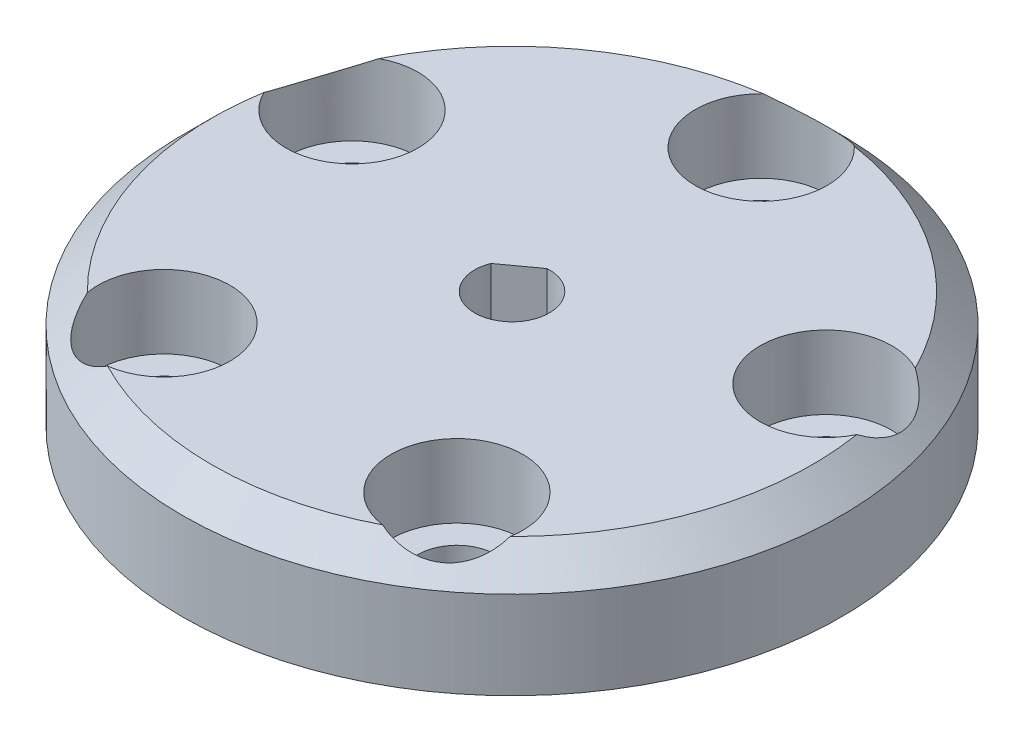
ISO-10303-21;
HEADER;
FILE_DESCRIPTION(('STEP AP214'),'2;1');
FILE_NAME('part.step','',(''),(''),'','','');
FILE_SCHEMA(('AUTOMOTIVE_DESIGN { 1 0 10303 214 1 1 1 1 }'));
ENDSEC;
DATA;
#1=APPLICATION_CONTEXT('core data for automotive mechanical design processes');
#2=APPLICATION_PROTOCOL_DEFINITION('international standard','automotive_design',2000,#1);
#3=PRODUCT_CONTEXT('',#1,'mechanical');
#4=PRODUCT('Part','Part','',(#3));
#5=PRODUCT_RELATED_PRODUCT_CATEGORY('part','',(#4));
#6=PRODUCT_DEFINITION_FORMATION('','',#4);
#7=PRODUCT_DEFINITION_CONTEXT('part definition',#1,'design');
#8=PRODUCT_DEFINITION('design','',#6,#7);
#9=PRODUCT_DEFINITION_SHAPE('','',#8);
#10=(LENGTH_UNIT() NAMED_UNIT(*) SI_UNIT(.MILLI.,.METRE.));
#11=(NAMED_UNIT(*) PLANE_ANGLE_UNIT() SI_UNIT($,.RADIAN.));
#12=(NAMED_UNIT(*) SI_UNIT($,.STERADIAN.) SOLID_ANGLE_UNIT());
#13=UNCERTAINTY_MEASURE_WITH_UNIT(LENGTH_MEASURE(1.E-05),#10,'distance_accuracy_value','');
#14=(GEOMETRIC_REPRESENTATION_CONTEXT(3) GLOBAL_UNCERTAINTY_ASSIGNED_CONTEXT((#13)) GLOBAL_UNIT_ASSIGNED_CONTEXT((#10,
#11,#12)) REPRESENTATION_CONTEXT('',''));
#15=CARTESIAN_POINT('',(0.,0.,0.));
#16=DIRECTION('',(0.,0.,1.));
#17=DIRECTION('',(1.,0.,0.));
#18=AXIS2_PLACEMENT_3D('',#15,#16,#17);
#19=CARTESIAN_POINT('',(0.,8.,-17.0130161670408));
#20=DIRECTION('',(0.,-1.,0.));
#21=DIRECTION('',(0.,0.,-1.));
#22=AXIS2_PLACEMENT_3D('',#19,#20,#21);
#23=CYLINDRICAL_SURFACE('',#22,2.65);
#24=CARTESIAN_POINT('',(0.,0.,-17.0130161670408));
#25=DIRECTION('',(0.,1.,0.));
#26=DIRECTION('',(0.,0.,1.));
#27=AXIS2_PLACEMENT_3D('',#24,#25,#26);
#28=CIRCLE('',#27,2.65);
#29=CARTESIAN_POINT('',(0.,0.,-14.3630161670408));
#30=VERTEX_POINT('',#29);
#31=EDGE_CURVE('E157',#30,#30,#28,.T.);
#32=ORIENTED_EDGE('',*,*,#31,.F.);
#33=EDGE_LOOP('',(#32));
#34=FACE_BOUND('',#33,.T.);
#35=CARTESIAN_POINT('',(0.,3.,-17.0130161670408));
#36=DIRECTION('',(0.,1.,0.));
#37=DIRECTION('',(0.,0.,1.));
#38=AXIS2_PLACEMENT_3D('',#35,#36,#37);
#39=CIRCLE('',#38,2.65);
#40=CARTESIAN_POINT('',(0.,3.,-14.3630161670408));
#41=VERTEX_POINT('',#40);
#42=EDGE_CURVE('E148',#41,#41,#39,.T.);
#43=ORIENTED_EDGE('',*,*,#42,.T.);
#44=EDGE_LOOP('',(#43));
#45=FACE_BOUND('',#44,.T.);
#46=ADVANCED_FACE('F35',(#34,#45),#23,.F.);
#47=CARTESIAN_POINT('',(-16.180339887499,8.,-5.25731112119133));
#48=DIRECTION('',(0.,-1.,0.));
#49=DIRECTION('',(0.,0.,-1.));
#50=AXIS2_PLACEMENT_3D('',#47,#48,#49);
#51=CYLINDRICAL_SURFACE('',#50,2.65);
#52=CARTESIAN_POINT('',(-16.180339887499,0.,-5.25731112119133));
#53=DIRECTION('',(0.,1.,0.));
#54=DIRECTION('',(0.,0.,1.));
#55=AXIS2_PLACEMENT_3D('',#52,#53,#54);
#56=CIRCLE('',#55,2.65);
#57=CARTESIAN_POINT('',(-16.180339887499,0.,-2.60731112119133));
#58=VERTEX_POINT('',#57);
#59=EDGE_CURVE('E154',#58,#58,#56,.T.);
#60=ORIENTED_EDGE('',*,*,#59,.F.);
#61=EDGE_LOOP('',(#60));
#62=FACE_BOUND('',#61,.T.);
#63=CARTESIAN_POINT('',(-16.180339887499,3.,-5.25731112119133));
#64=DIRECTION('',(0.,1.,0.));
#65=DIRECTION('',(0.,0.,1.));
#66=AXIS2_PLACEMENT_3D('',#63,#64,#65);
#67=CIRCLE('',#66,2.65);
#68=CARTESIAN_POINT('',(-16.180339887499,3.,-2.60731112119133));
#69=VERTEX_POINT('',#68);
#70=EDGE_CURVE('E172',#69,#69,#67,.T.);
#71=ORIENTED_EDGE('',*,*,#70,.T.);
#72=EDGE_LOOP('',(#71));
#73=FACE_BOUND('',#72,.T.);
#74=ADVANCED_FACE('F221',(#62,#73),#51,.F.);
#75=CARTESIAN_POINT('',(-10.,8.,13.7638192047117));
#76=DIRECTION('',(0.,-1.,0.));
#77=DIRECTION('',(0.,0.,-1.));
#78=AXIS2_PLACEMENT_3D('',#75,#76,#77);
#79=CYLINDRICAL_SURFACE('',#78,2.65);
#80=CARTESIAN_POINT('',(-10.,0.,13.7638192047117));
#81=DIRECTION('',(0.,1.,0.));
#82=DIRECTION('',(0.,0.,1.));
#83=AXIS2_PLACEMENT_3D('',#80,#81,#82);
#84=CIRCLE('',#83,2.65);
#85=CARTESIAN_POINT('',(-10.,0.,16.4138192047117));
#86=VERTEX_POINT('',#85);
#87=EDGE_CURVE('E151',#86,#86,#84,.T.);
#88=ORIENTED_EDGE('',*,*,#87,.F.);
#89=EDGE_LOOP('',(#88));
#90=FACE_BOUND('',#89,.T.);
#91=CARTESIAN_POINT('',(-10.,3.,13.7638192047117));
#92=DIRECTION('',(0.,1.,0.));
#93=DIRECTION('',(0.,0.,1.));
#94=AXIS2_PLACEMENT_3D('',#91,#92,#93);
#95=CIRCLE('',#94,2.65);
#96=CARTESIAN_POINT('',(-10.,3.,16.4138192047117));
#97=VERTEX_POINT('',#96);
#98=EDGE_CURVE('E169',#97,#97,#95,.T.);
#99=ORIENTED_EDGE('',*,*,#98,.T.);
#100=EDGE_LOOP('',(#99));
#101=FACE_BOUND('',#100,.T.);
#102=ADVANCED_FACE('F217',(#90,#101),#79,.F.);
#103=CARTESIAN_POINT('',(10.,8.,13.7638192047117));
#104=DIRECTION('',(0.,-1.,0.));
#105=DIRECTION('',(0.,0.,-1.));
#106=AXIS2_PLACEMENT_3D('',#103,#104,#105);
#107=CYLINDRICAL_SURFACE('',#106,2.65);
#108=CARTESIAN_POINT('',(10.,0.,13.7638192047117));
#109=DIRECTION('',(0.,1.,0.));
#110=DIRECTION('',(0.,0.,1.));
#111=AXIS2_PLACEMENT_3D('',#108,#109,#110);
#112=CIRCLE('',#111,2.65);
#113=CARTESIAN_POINT('',(10.,0.,16.4138192047117));
#114=VERTEX_POINT('',#113);
#115=EDGE_CURVE('E147',#114,#114,#112,.T.);
#116=ORIENTED_EDGE('',*,*,#115,.F.);
#117=EDGE_LOOP('',(#116));
#118=FACE_BOUND('',#117,.T.);
#119=CARTESIAN_POINT('',(10.,3.,13.7638192047117));
#120=DIRECTION('',(0.,1.,0.));
#121=DIRECTION('',(0.,0.,1.));
#122=AXIS2_PLACEMENT_3D('',#119,#120,#121);
#123=CIRCLE('',#122,2.65);
#124=CARTESIAN_POINT('',(10.,3.,16.4138192047117));
#125=VERTEX_POINT('',#124);
#126=EDGE_CURVE('E166',#125,#125,#123,.T.);
#127=ORIENTED_EDGE('',*,*,#126,.T.);
#128=EDGE_LOOP('',(#127));
#129=FACE_BOUND('',#128,.T.);
#130=ADVANCED_FACE('F213',(#118,#129),#107,.F.);
#131=CARTESIAN_POINT('',(16.180339887499,8.,-5.25731112119134));
#132=DIRECTION('',(0.,-1.,0.));
#133=DIRECTION('',(0.,0.,-1.));
#134=AXIS2_PLACEMENT_3D('',#131,#132,#133);
#135=CYLINDRICAL_SURFACE('',#134,2.65);
#136=CARTESIAN_POINT('',(16.180339887499,0.,-5.25731112119134));
#137=DIRECTION('',(0.,1.,0.));
#138=DIRECTION('',(0.,0.,1.));
#139=AXIS2_PLACEMENT_3D('',#136,#137,#138);
#140=CIRCLE('',#139,2.65);
#141=CARTESIAN_POINT('',(16.180339887499,0.,-2.60731112119134));
#142=VERTEX_POINT('',#141);
#143=EDGE_CURVE('E144',#142,#142,#140,.T.);
#144=ORIENTED_EDGE('',*,*,#143,.F.);
#145=EDGE_LOOP('',(#144));
#146=FACE_BOUND('',#145,.T.);
#147=CARTESIAN_POINT('',(16.180339887499,3.,-5.25731112119134));
#148=DIRECTION('',(0.,1.,0.));
#149=DIRECTION('',(0.,0.,1.));
#150=AXIS2_PLACEMENT_3D('',#147,#148,#149);
#151=CIRCLE('',#150,2.65);
#152=CARTESIAN_POINT('',(16.180339887499,3.,-2.60731112119134));
#153=VERTEX_POINT('',#152);
#154=EDGE_CURVE('E141',#153,#153,#151,.T.);
#155=ORIENTED_EDGE('',*,*,#154,.T.);
#156=EDGE_LOOP('',(#155));
#157=FACE_BOUND('',#156,.T.);
#158=ADVANCED_FACE('F209',(#146,#157),#135,.F.);
#159=CARTESIAN_POINT('',(0.,8.,0.));
#160=DIRECTION('',(0.,1.,0.));
#161=DIRECTION('',(0.,0.,1.));
#162=AXIS2_PLACEMENT_3D('',#159,#160,#161);
#163=PLANE('',#162);
#164=CARTESIAN_POINT('',(0.,8.,0.));
#165=DIRECTION('',(0.,1.,0.));
#166=DIRECTION('',(0.,0.,1.));
#167=AXIS2_PLACEMENT_3D('',#164,#165,#166);
#168=CIRCLE('',#167,2.55);
#169=CARTESIAN_POINT('',(-2.37300650828666,8.,-0.933456004120784));
#170=VERTEX_POINT('',#169);
#171=CARTESIAN_POINT('',(-0.154470076570965,8.,-2.54531707169149));
#172=VERTEX_POINT('',#171);
#173=EDGE_CURVE('E96',#170,#172,#168,.T.);
#174=ORIENTED_EDGE('',*,*,#173,.F.);
#175=DIRECTION('',(0.809016994374948,0.,-0.587785252292472));
#176=VECTOR('',#175,1.);
#177=CARTESIAN_POINT('',(-1.26373829242881,8.,-1.73938653790614));
#178=LINE('',#177,#176);
#179=EDGE_CURVE('E98',#170,#172,#178,.T.);
#180=ORIENTED_EDGE('',*,*,#179,.T.);
#181=EDGE_LOOP('',(#174,#180));
#182=FACE_BOUND('',#181,.T.);
#183=CARTESIAN_POINT('',(0.,8.,-17.0130161670408));
#184=DIRECTION('',(0.,1.,0.));
#185=DIRECTION('',(0.,0.,1.));
#186=AXIS2_PLACEMENT_3D('',#183,#184,#185);
#187=CIRCLE('',#186,4.5);
#188=CARTESIAN_POINT('',(-3.11331320300285,8.,-20.2622131293698));
#189=VERTEX_POINT('',#188);
#190=CARTESIAN_POINT('',(3.11331320300284,8.,-20.2622131293698));
#191=VERTEX_POINT('',#190);
#192=EDGE_CURVE('E118',#189,#191,#187,.T.);
#193=ORIENTED_EDGE('',*,*,#192,.F.);
#194=CARTESIAN_POINT('',(0.,8.,0.));
#195=DIRECTION('',(0.,1.,0.));
#196=DIRECTION('',(0.,0.,1.));
#197=AXIS2_PLACEMENT_3D('',#194,#195,#196);
#198=CIRCLE('',#197,20.5);
#199=CARTESIAN_POINT('',(-18.3084431427086,8.,-9.22230500960604));
#200=VERTEX_POINT('',#199);
#201=EDGE_CURVE('E184',#189,#200,#198,.T.);
#202=ORIENTED_EDGE('',*,*,#201,.T.);
#203=CARTESIAN_POINT('',(-16.180339887499,8.,-5.25731112119133));
#204=DIRECTION('',(0.,1.,0.));
#205=DIRECTION('',(0.,0.,1.));
#206=AXIS2_PLACEMENT_3D('',#203,#204,#205);
#207=CIRCLE('',#206,4.5);
#208=CARTESIAN_POINT('',(-20.2325765197882,8.,-3.30043139163885));
#209=VERTEX_POINT('',#208);
#210=EDGE_CURVE('E117',#209,#200,#207,.T.);
#211=ORIENTED_EDGE('',*,*,#210,.F.);
#212=CARTESIAN_POINT('',(0.,8.,0.));
#213=DIRECTION('',(0.,1.,0.));
#214=DIRECTION('',(0.,0.,1.));
#215=AXIS2_PLACEMENT_3D('',#212,#213,#214);
#216=CIRCLE('',#215,20.5);
#217=CARTESIAN_POINT('',(-14.4285533462917,8.,14.5625151788149));
#218=VERTEX_POINT('',#217);
#219=EDGE_CURVE('E182',#209,#218,#216,.T.);
#220=ORIENTED_EDGE('',*,*,#219,.T.);
#221=CARTESIAN_POINT('',(-10.,8.,13.7638192047117));
#222=DIRECTION('',(0.,1.,0.));
#223=DIRECTION('',(0.,0.,1.));
#224=AXIS2_PLACEMENT_3D('',#221,#222,#223);
#225=CIRCLE('',#224,4.5);
#226=CARTESIAN_POINT('',(-9.3911067662093,8.,18.2224343517999));
#227=VERTEX_POINT('',#226);
#228=EDGE_CURVE('E113',#227,#218,#225,.T.);
#229=ORIENTED_EDGE('',*,*,#228,.F.);
#230=CARTESIAN_POINT('',(0.,8.,0.));
#231=DIRECTION('',(0.,1.,0.));
#232=DIRECTION('',(0.,0.,1.));
#233=AXIS2_PLACEMENT_3D('',#230,#231,#232);
#234=CIRCLE('',#233,20.5);
#235=CARTESIAN_POINT('',(9.3911067662093,8.,18.2224343517999));
#236=VERTEX_POINT('',#235);
#237=EDGE_CURVE('E180',#227,#236,#234,.T.);
#238=ORIENTED_EDGE('',*,*,#237,.T.);
#239=CARTESIAN_POINT('',(10.,8.,13.7638192047117));
#240=DIRECTION('',(0.,1.,0.));
#241=DIRECTION('',(0.,0.,1.));
#242=AXIS2_PLACEMENT_3D('',#239,#240,#241);
#243=CIRCLE('',#242,4.5);
#244=CARTESIAN_POINT('',(14.4285533462917,8.,14.5625151788149));
#245=VERTEX_POINT('',#244);
#246=EDGE_CURVE('E130',#245,#236,#243,.T.);
#247=ORIENTED_EDGE('',*,*,#246,.F.);
#248=CARTESIAN_POINT('',(0.,8.,0.));
#249=DIRECTION('',(0.,1.,0.));
#250=DIRECTION('',(0.,0.,1.));
#251=AXIS2_PLACEMENT_3D('',#248,#249,#250);
#252=CIRCLE('',#251,20.5);
#253=CARTESIAN_POINT('',(20.2325765197882,8.,-3.30043139163886));
#254=VERTEX_POINT('',#253);
#255=EDGE_CURVE('E178',#245,#254,#252,.T.);
#256=ORIENTED_EDGE('',*,*,#255,.T.);
#257=CARTESIAN_POINT('',(16.180339887499,8.,-5.25731112119134));
#258=DIRECTION('',(0.,1.,0.));
#259=DIRECTION('',(0.,0.,1.));
#260=AXIS2_PLACEMENT_3D('',#257,#258,#259);
#261=CIRCLE('',#260,4.5);
#262=CARTESIAN_POINT('',(18.3084431427086,8.,-9.22230500960606));
#263=VERTEX_POINT('',#262);
#264=EDGE_CURVE('E124',#263,#254,#261,.T.);
#265=ORIENTED_EDGE('',*,*,#264,.F.);
#266=CARTESIAN_POINT('',(0.,8.,0.));
#267=DIRECTION('',(0.,1.,0.));
#268=DIRECTION('',(0.,0.,1.));
#269=AXIS2_PLACEMENT_3D('',#266,#267,#268);
#270=CIRCLE('',#269,20.5);
#271=EDGE_CURVE('E163',#263,#191,#270,.T.);
#272=ORIENTED_EDGE('',*,*,#271,.T.);
#273=EDGE_LOOP('',(#193,#202,#211,#220,#229,#238,#247,#256,#265,#272));
#274=FACE_BOUND('',#273,.T.);
#275=ADVANCED_FACE('F212',(#182,#274),#163,.T.);
#276=CARTESIAN_POINT('',(0.,0.,0.));
#277=DIRECTION('',(0.,1.,0.));
#278=DIRECTION('',(0.,0.,1.));
#279=AXIS2_PLACEMENT_3D('',#276,#277,#278);
#280=PLANE('',#279);
#281=DIRECTION('',(-0.809016994374949,0.,0.587785252292472));
#282=VECTOR('',#281,1.);
#283=CARTESIAN_POINT('',(-0.154470076570965,0.,-2.54531707169149));
#284=LINE('',#283,#282);
#285=CARTESIAN_POINT('',(-0.154470076570965,0.,-2.54531707169149));
#286=VERTEX_POINT('',#285);
#287=CARTESIAN_POINT('',(-2.37300650828666,0.,-0.933456004120784));
#288=VERTEX_POINT('',#287);
#289=EDGE_CURVE('E102',#286,#288,#284,.T.);
#290=ORIENTED_EDGE('',*,*,#289,.T.);
#291=CARTESIAN_POINT('',(0.,0.,0.));
#292=DIRECTION('',(0.,-1.,0.));
#293=DIRECTION('',(0.,0.,-1.));
#294=AXIS2_PLACEMENT_3D('',#291,#292,#293);
#295=CIRCLE('',#294,2.55);
#296=EDGE_CURVE('E59',#286,#288,#295,.T.);
#297=ORIENTED_EDGE('',*,*,#296,.F.);
#298=EDGE_LOOP('',(#290,#297));
#299=FACE_BOUND('',#298,.T.);
#300=CARTESIAN_POINT('',(0.,0.,0.));
#301=DIRECTION('',(0.,1.,0.));
#302=DIRECTION('',(0.,0.,1.));
#303=AXIS2_PLACEMENT_3D('',#300,#301,#302);
#304=CIRCLE('',#303,22.5);
#305=CARTESIAN_POINT('',(0.,0.,22.5));
#306=VERTEX_POINT('',#305);
#307=EDGE_CURVE('E160',#306,#306,#304,.T.);
#308=ORIENTED_EDGE('',*,*,#307,.F.);
#309=EDGE_LOOP('',(#308));
#310=FACE_BOUND('',#309,.T.);
#311=ORIENTED_EDGE('',*,*,#31,.T.);
#312=EDGE_LOOP('',(#311));
#313=FACE_BOUND('',#312,.T.);
#314=ORIENTED_EDGE('',*,*,#59,.T.);
#315=EDGE_LOOP('',(#314));
#316=FACE_BOUND('',#315,.T.);
#317=ORIENTED_EDGE('',*,*,#87,.T.);
#318=EDGE_LOOP('',(#317));
#319=FACE_BOUND('',#318,.T.);
#320=ORIENTED_EDGE('',*,*,#115,.T.);
#321=EDGE_LOOP('',(#320));
#322=FACE_BOUND('',#321,.T.);
#323=ORIENTED_EDGE('',*,*,#143,.T.);
#324=EDGE_LOOP('',(#323));
#325=FACE_BOUND('',#324,.T.);
#326=ADVANCED_FACE('F106',(#299,#310,#313,#316,#319,#322,#325),#280,.F.);
#327=CARTESIAN_POINT('',(0.,8.,0.));
#328=DIRECTION('',(0.,-1.,0.));
#329=DIRECTION('',(0.,0.,-1.));
#330=AXIS2_PLACEMENT_3D('',#327,#328,#329);
#331=CYLINDRICAL_SURFACE('',#330,22.5);
#332=CARTESIAN_POINT('',(0.,5.99999999999999,0.));
#333=DIRECTION('',(0.,1.,0.));
#334=DIRECTION('',(0.,0.,1.));
#335=AXIS2_PLACEMENT_3D('',#332,#333,#334);
#336=CIRCLE('',#335,22.5);
#337=CARTESIAN_POINT('',(0.,5.99999999999999,22.5));
#338=VERTEX_POINT('',#337);
#339=EDGE_CURVE('E11',#338,#338,#336,.F.);
#340=ORIENTED_EDGE('',*,*,#339,.T.);
#341=EDGE_LOOP('',(#340));
#342=FACE_BOUND('',#341,.T.);
#343=ORIENTED_EDGE('',*,*,#307,.T.);
#344=EDGE_LOOP('',(#343));
#345=FACE_BOUND('',#344,.T.);
#346=ADVANCED_FACE('F233',(#342,#345),#331,.T.);
#347=CARTESIAN_POINT('',(16.180339887499,3.,-5.25731112119134));
#348=DIRECTION('',(0.,1.,0.));
#349=DIRECTION('',(0.,0.,1.));
#350=AXIS2_PLACEMENT_3D('',#347,#348,#349);
#351=CYLINDRICAL_SURFACE('',#350,4.5);
#352=CARTESIAN_POINT('',(16.180339887499,3.,-5.25731112119134));
#353=DIRECTION('',(0.,1.,0.));
#354=DIRECTION('',(0.,0.,1.));
#355=AXIS2_PLACEMENT_3D('',#352,#353,#354);
#356=CIRCLE('',#355,4.5);
#357=CARTESIAN_POINT('',(16.180339887499,3.,-0.757311121191336));
#358=VERTEX_POINT('',#357);
#359=EDGE_CURVE('E121',#358,#358,#356,.T.);
#360=ORIENTED_EDGE('',*,*,#359,.F.);
#361=EDGE_LOOP('',(#360));
#362=FACE_BOUND('',#361,.T.);
#363=ORIENTED_EDGE('',*,*,#264,.T.);
#364=CARTESIAN_POINT('',(20.2325765197882,8.,-3.30043139163886));
#365=CARTESIAN_POINT('',(20.2784879394016,7.93938254505587,-3.39549241689349));
#366=CARTESIAN_POINT('',(20.3215302454278,7.88062856924467,-3.49317733301918));
#367=CARTESIAN_POINT('',(20.401273490154,7.76727598909852,-3.69355025025706));
#368=CARTESIAN_POINT('',(20.4379685675522,7.71268125133422,-3.79624276462501));
#369=CARTESIAN_POINT('',(20.5045805384392,7.60779026284705,-4.00701091429525));
#370=CARTESIAN_POINT('',(20.5344436074299,7.5575299674145,-4.11512162912199));
#371=CARTESIAN_POINT('',(20.5863603938743,7.4623197730824,-4.33546971697807));
#372=CARTESIAN_POINT('',(20.6084154168874,7.41736898723451,-4.44770639664993));
#373=CARTESIAN_POINT('',(20.644193908388,7.33305430307299,-4.67638020979375));
#374=CARTESIAN_POINT('',(20.6578649777937,7.29372669686443,-4.79283903762311));
#375=CARTESIAN_POINT('',(20.6760646708449,7.22156564093341,-5.0283953529179));
#376=CARTESIAN_POINT('',(20.680598530264,7.18872848181236,-5.14749128969622));
#377=CARTESIAN_POINT('',(20.6800593102242,7.13013252936012,-5.38700483187843));
#378=CARTESIAN_POINT('',(20.6750165402601,7.10435169855776,-5.50741707224916));
#379=CARTESIAN_POINT('',(20.6550597585993,7.06018320904285,-5.7487751265461));
#380=CARTESIAN_POINT('',(20.6401474934789,7.04179424313846,-5.86972084230358));
#381=CARTESIAN_POINT('',(20.6027405333739,7.01450371869434,-6.09631212606183));
#382=CARTESIAN_POINT('',(20.5813795710874,7.00472435010834,-6.20204082818947));
#383=CARTESIAN_POINT('',(20.5309990399496,6.99128795900437,-6.41204979545862));
#384=CARTESIAN_POINT('',(20.5019801850969,6.98763036594397,-6.51633019468186));
#385=CARTESIAN_POINT('',(20.4364706116171,6.98649393021964,-6.72259825326284));
#386=CARTESIAN_POINT('',(20.399976777623,6.98901766858693,-6.82458493693032));
#387=CARTESIAN_POINT('',(20.319863859578,7.00020911064667,-7.0253678257735));
#388=CARTESIAN_POINT('',(20.2762450092594,7.00887661282745,-7.12416413548037));
#389=CARTESIAN_POINT('',(20.1860628614482,7.03129743974578,-7.31011309896922));
#390=CARTESIAN_POINT('',(20.1400072017619,7.04459305384921,-7.39756787771734));
#391=CARTESIAN_POINT('',(20.0426710826441,7.07611023264992,-7.56860907397541));
#392=CARTESIAN_POINT('',(19.9913888641338,7.09433345924522,-7.6521941752296));
#393=CARTESIAN_POINT('',(19.8304503484199,7.15607564472022,-7.89636172813894));
#394=CARTESIAN_POINT('',(19.7136096704546,7.20669043208679,-8.05054531502537));
#395=CARTESIAN_POINT('',(19.4583256967049,7.32785663840789,-8.34684109175653));
#396=CARTESIAN_POINT('',(19.3190535256065,7.39934195738516,-8.487842041887));
#397=CARTESIAN_POINT('',(19.0285573513626,7.55821531026083,-8.74665043594844));
#398=CARTESIAN_POINT('',(18.8773311839369,7.64560622762781,-8.86445366637341));
#399=CARTESIAN_POINT('',(18.6545325407865,7.78062470288469,-9.01698423123113));
#400=CARTESIAN_POINT('',(18.5860140782009,7.82296144592788,-9.06116244292883));
#401=CARTESIAN_POINT('',(18.4479664433328,7.90984606911608,-9.14503052669916));
#402=CARTESIAN_POINT('',(18.3784404736482,7.95438771620443,-9.18473211567404));
#403=CARTESIAN_POINT('',(18.3084431427086,8.,-9.22230500960606));
#404=B_SPLINE_CURVE_WITH_KNOTS('',3,(#364,#365,#366,#367,#368,#369,#370,#371,#372,#373,#374,
#375,#376,#377,#378,#379,#380,#381,#382,#383,#384,#385,#386,#387,#388,#389,#390,#391,#392,#393,
#394,#395,#396,#397,#398,#399,#400,#401,#402,#403),.UNSPECIFIED.,.F.,.F.,(4,2,2,2,2,2,2,2,2,2,2,
2,2,2,2,2,2,2,2,4),(0.,0.365181244948056,0.730697934104198,1.09900205519338,1.46724456416849,
1.83776571097421,2.20807448255614,2.57721320054625,2.94628661057405,3.27077048017692,
3.59522410657244,3.91981323252807,4.24439171265327,4.54323617337946,4.84218154906366,
5.43944487556948,6.06916351640424,6.69899643057579,6.97447657144119,7.24921807189481),.UNSPECIFIED.);
#405=EDGE_CURVE('E267',#254,#263,#404,.T.);
#406=ORIENTED_EDGE('',*,*,#405,.T.);
#407=EDGE_LOOP('',(#363,#406));
#408=FACE_BOUND('',#407,.T.);
#409=ADVANCED_FACE('F235',(#362,#408),#351,.F.);
#410=CARTESIAN_POINT('',(16.180339887499,3.,-5.25731112119134));
#411=DIRECTION('',(0.,1.,0.));
#412=DIRECTION('',(0.,0.,1.));
#413=AXIS2_PLACEMENT_3D('',#410,#411,#412);
#414=PLANE('',#413);
#415=ORIENTED_EDGE('',*,*,#154,.F.);
#416=EDGE_LOOP('',(#415));
#417=FACE_BOUND('',#416,.T.);
#418=ORIENTED_EDGE('',*,*,#359,.T.);
#419=EDGE_LOOP('',(#418));
#420=FACE_BOUND('',#419,.T.);
#421=ADVANCED_FACE('F240',(#417,#420),#414,.T.);
#422=CARTESIAN_POINT('',(10.,3.,13.7638192047117));
#423=DIRECTION('',(0.,1.,0.));
#424=DIRECTION('',(0.,0.,1.));
#425=AXIS2_PLACEMENT_3D('',#422,#423,#424);
#426=CYLINDRICAL_SURFACE('',#425,4.5);
#427=CARTESIAN_POINT('',(10.,3.,13.7638192047117));
#428=DIRECTION('',(0.,1.,0.));
#429=DIRECTION('',(0.,0.,1.));
#430=AXIS2_PLACEMENT_3D('',#427,#428,#429);
#431=CIRCLE('',#430,4.5);
#432=CARTESIAN_POINT('',(10.,3.,18.2638192047117));
#433=VERTEX_POINT('',#432);
#434=EDGE_CURVE('E127',#433,#433,#431,.T.);
#435=ORIENTED_EDGE('',*,*,#434,.F.);
#436=EDGE_LOOP('',(#435));
#437=FACE_BOUND('',#436,.T.);
#438=ORIENTED_EDGE('',*,*,#246,.T.);
#439=CARTESIAN_POINT('',(9.3911067662093,8.,18.2224343517999));
#440=CARTESIAN_POINT('',(9.49570258261985,7.93938254505587,18.2367232342892));
#441=CARTESIAN_POINT('',(9.60190726268411,7.88062856924467,18.2474726007349));
#442=CARTESIAN_POINT('',(9.81711524911926,7.76727598909852,18.2613942966233));
#443=CARTESIAN_POINT('',(9.92612103660957,7.71268125133421,18.2645596569639));
#444=CARTESIAN_POINT('',(10.1471576898138,7.60779026284705,18.2627804658183));
#445=CARTESIAN_POINT('',(10.2592052854535,7.5575299674145,18.257773884023));
#446=CARTESIAN_POINT('',(10.4848119395668,7.4623197730824,18.2390583782505));
#447=CARTESIAN_POINT('',(10.5983707420584,7.41736898723452,18.2253509101932));
#448=CARTESIAN_POINT('',(10.8269086240617,7.33305430307299,18.1887141832482));
#449=CARTESIAN_POINT('',(10.9418921439265,7.29372669686443,18.1657283859469));
#450=CARTESIAN_POINT('',(11.1715435269874,7.22156564093341,18.1102464180594));
#451=CARTESIAN_POINT('',(11.2862115333353,7.18872848181236,18.0777557061784));
#452=CARTESIAN_POINT('',(11.5138358202126,7.13013252936012,18.0032291225286));
#453=CARTESIAN_POINT('',(11.6267963644412,7.10435169855776,17.9612237346887));
#454=CARTESIAN_POINT('',(11.8501745300545,7.06018320904285,17.8676599669389));
#455=CARTESIAN_POINT('',(11.9605925977968,7.04179424313846,17.8161032784576));
#456=CARTESIAN_POINT('',(12.1645343283704,7.01450371869434,17.7105065878364));
#457=CARTESIAN_POINT('',(12.2584873991256,7.00472435010834,17.6575191397088));
#458=CARTESIAN_POINT('',(12.4426493556201,6.99128795900437,17.5447080674185));
#459=CARTESIAN_POINT('',(12.5328585895164,6.98763036594398,17.4848850808752));
#460=CARTESIAN_POINT('',(12.7087875992339,6.98649393021965,17.3588414386393));
#461=CARTESIAN_POINT('',(12.7945054844171,6.98901766858693,17.2926181215614));
#462=CARTESIAN_POINT('',(12.9607051060671,7.00020911064667,17.1543808839831));
#463=CARTESIAN_POINT('',(13.0411870141762,7.00887661282745,17.0823671534733));
#464=CARTESIAN_POINT('',(13.1901671713377,7.03129743974579,16.9391374443395));
#465=CARTESIAN_POINT('',(13.259109627017,7.04459305384922,16.8683108962101));
#466=CARTESIAN_POINT('',(13.3917009562993,7.07611023264993,16.7228841094703));
#467=CARTESIAN_POINT('',(13.4553480344833,7.09433345924522,16.6482826046218));
#468=CARTESIAN_POINT('',(13.6378324403406,7.15607564472023,16.4197690572054));
#469=CARTESIAN_POINT('',(13.7483639902291,7.20669043208679,16.2610016204565));
#470=CARTESIAN_POINT('',(13.9512709331598,7.32785663840789,15.9266517033447));
#471=CARTESIAN_POINT('',(14.0423333378722,7.39934195738517,15.7506243076696));
#472=CARTESIAN_POINT('',(14.198706492874,7.55821531026084,15.3943698361443));
#473=CARTESIAN_POINT('',(14.2640125670815,7.64560622762781,15.2141420039862));
#474=CARTESIAN_POINT('',(14.3402291876665,7.7806247028847,14.9551133658936));
#475=CARTESIAN_POINT('',(14.3610717944125,7.82296144592788,14.8762966173694));
#476=CARTESIAN_POINT('',(14.3981760167839,7.90984606911608,14.7190888514982));
#477=CARTESIAN_POINT('',(14.4144497655028,7.95438771620443,14.6406972592811));
#478=CARTESIAN_POINT('',(14.4285533462917,8.,14.5625151788149));
#479=B_SPLINE_CURVE_WITH_KNOTS('',3,(#439,#440,#441,#442,#443,#444,#445,#446,#447,#448,#449,
#450,#451,#452,#453,#454,#455,#456,#457,#458,#459,#460,#461,#462,#463,#464,#465,#466,#467,#468,
#469,#470,#471,#472,#473,#474,#475,#476,#477,#478),.UNSPECIFIED.,.F.,.F.,(4,2,2,2,2,2,2,2,2,2,2,
2,2,2,2,2,2,2,2,4),(0.,0.365181244948057,0.730697934104198,1.09900205519339,1.46724456416849,
1.8377657109742,2.20807448255614,2.57721320054625,2.94628661057405,3.27077048017692,
3.59522410657243,3.91981323252806,4.24439171265327,4.54323617337946,4.84218154906366,
5.43944487556948,6.06916351640424,6.69899643057579,6.97447657144119,7.2492180718948),.UNSPECIFIED.);
#480=EDGE_CURVE('E274',#236,#245,#479,.T.);
#481=ORIENTED_EDGE('',*,*,#480,.T.);
#482=EDGE_LOOP('',(#438,#481));
#483=FACE_BOUND('',#482,.T.);
#484=ADVANCED_FACE('F261',(#437,#483),#426,.F.);
#485=CARTESIAN_POINT('',(10.,3.,13.7638192047117));
#486=DIRECTION('',(0.,1.,0.));
#487=DIRECTION('',(0.,0.,1.));
#488=AXIS2_PLACEMENT_3D('',#485,#486,#487);
#489=PLANE('',#488);
#490=ORIENTED_EDGE('',*,*,#126,.F.);
#491=EDGE_LOOP('',(#490));
#492=FACE_BOUND('',#491,.T.);
#493=ORIENTED_EDGE('',*,*,#434,.T.);
#494=EDGE_LOOP('',(#493));
#495=FACE_BOUND('',#494,.T.);
#496=ADVANCED_FACE('F292',(#492,#495),#489,.T.);
#497=CARTESIAN_POINT('',(-10.,3.,13.7638192047117));
#498=DIRECTION('',(0.,1.,0.));
#499=DIRECTION('',(0.,0.,1.));
#500=AXIS2_PLACEMENT_3D('',#497,#498,#499);
#501=CYLINDRICAL_SURFACE('',#500,4.5);
#502=CARTESIAN_POINT('',(-10.,3.,13.7638192047117));
#503=DIRECTION('',(0.,1.,0.));
#504=DIRECTION('',(0.,0.,1.));
#505=AXIS2_PLACEMENT_3D('',#502,#503,#504);
#506=CIRCLE('',#505,4.5);
#507=CARTESIAN_POINT('',(-10.,3.,18.2638192047117));
#508=VERTEX_POINT('',#507);
#509=EDGE_CURVE('E133',#508,#508,#506,.T.);
#510=ORIENTED_EDGE('',*,*,#509,.F.);
#511=EDGE_LOOP('',(#510));
#512=FACE_BOUND('',#511,.T.);
#513=ORIENTED_EDGE('',*,*,#228,.T.);
#514=CARTESIAN_POINT('',(-14.4285533462917,8.,14.5625151788149));
#515=CARTESIAN_POINT('',(-14.4098209962824,7.93938254505587,14.6664072191091));
#516=CARTESIAN_POINT('',(-14.3872252002646,7.88062856924467,14.7707356090558));
#517=CARTESIAN_POINT('',(-14.3339625947234,7.76727598909852,14.9797126075337));
#518=CARTESIAN_POINT('',(-14.3032883904821,7.71268125133422,15.0843614221788));
#519=CARTESIAN_POINT('',(-14.2332921969294,7.60779026284705,15.2940299712486));
#520=CARTESIAN_POINT('',(-14.1939060434571,7.5575299674145,15.3990464483584));
#521=CARTESIAN_POINT('',(-14.1063902495713,7.46231977308241,15.6078277175304));
#522=CARTESIAN_POINT('',(-14.0582620729228,7.41736898723452,15.7115927160432));
#523=CARTESIAN_POINT('',(-13.9527963856285,7.33305430307299,15.9176237866984));
#524=CARTESIAN_POINT('',(-13.8954037316116,7.29372669686444,16.0198766105371));
#525=CARTESIAN_POINT('',(-13.7716710643678,7.22156564093342,16.2211431839147));
#526=CARTESIAN_POINT('',(-13.7053361984417,7.18872848181236,16.3201587564318));
#527=CARTESIAN_POINT('',(-13.5641174324468,7.13013252936013,16.513612336853));
#528=CARTESIAN_POINT('',(-13.4892612067617,7.10435169855776,16.6080638198281));
#529=CARTESIAN_POINT('',(-13.3312491264073,7.06018320904285,16.7915962855402));
#530=CARTESIAN_POINT('',(-13.2480947424501,7.04179424313846,16.8806782154688));
#531=CARTESIAN_POINT('',(-13.0846448611262,7.01450371869435,17.0420071553236));
#532=CARTESIAN_POINT('',(-13.0052177077656,7.00472435010835,17.1149878135313));
#533=CARTESIAN_POINT('',(-12.8410188280794,6.99128795900438,17.2552757038177));
#534=CARTESIAN_POINT('',(-12.7562476005797,6.98763036594398,17.3225834640487));
#535=CARTESIAN_POINT('',(-12.5820079194873,6.98649393021965,17.450952267662));
#536=CARTESIAN_POINT('',(-12.4925375190063,6.98901766858693,17.5120106905276));
#537=CARTESIAN_POINT('',(-12.3097075858642,7.00020911064667,17.6273582680365));
#538=CARTESIAN_POINT('',(-12.2163481808547,7.00887661282746,17.6816476446316));
#539=CARTESIAN_POINT('',(-12.0340912322685,7.03129743974579,17.7790757796771));
#540=CARTESIAN_POINT('',(-11.9454267917044,7.04459305384922,17.8227573443754));
#541=CARTESIAN_POINT('',(-11.7661447244767,7.07611023264992,17.9039198435535));
#542=CARTESIAN_POINT('',(-11.675526448364,7.09433345924522,17.9413986791995));
#543=CARTESIAN_POINT('',(-11.4018063674135,7.15607564472023,18.0443370929157));
#544=CARTESIAN_POINT('',(-11.2166534347879,7.20669043208679,18.1003970075846));
#545=CARTESIAN_POINT('',(-10.8359660737537,7.32785663840789,18.190053171405));
#546=CARTESIAN_POINT('',(-10.6404142414457,7.39934195738516,18.2222632080571));
#547=CARTESIAN_POINT('',(-10.2532741424827,7.55821531026084,18.2608942300718));
#548=CARTESIAN_POINT('',(-10.0616866015248,7.64560622762781,18.2673105345043));
#549=CARTESIAN_POINT('',(-9.7917834963453,7.78062470288469,18.2597525969612));
#550=CARTESIAN_POINT('',(-9.71038359437656,7.82296144592788,18.2552193791882));
#551=CARTESIAN_POINT('',(-9.54940428895673,7.90984606911608,18.2419277203547));
#552=CARTESIAN_POINT('',(-9.46982058943951,7.95438771620443,18.2331806409072));
#553=CARTESIAN_POINT('',(-9.3911067662093,8.,18.2224343517999));
#554=B_SPLINE_CURVE_WITH_KNOTS('',3,(#514,#515,#516,#517,#518,#519,#520,#521,#522,#523,#524,
#525,#526,#527,#528,#529,#530,#531,#532,#533,#534,#535,#536,#537,#538,#539,#540,#541,#542,#543,
#544,#545,#546,#547,#548,#549,#550,#551,#552,#553),.UNSPECIFIED.,.F.,.F.,(4,2,2,2,2,2,2,2,2,2,2,
2,2,2,2,2,2,2,2,4),(0.,0.365181244948056,0.730697934104195,1.09900205519338,1.46724456416848,
1.8377657109742,2.20807448255613,2.57721320054624,2.94628661057404,3.27077048017691,
3.59522410657243,3.91981323252806,4.24439171265327,4.54323617337946,4.84218154906366,
5.43944487556948,6.06916351640423,6.69899643057579,6.97447657144119,7.2492180718948),.UNSPECIFIED.);
#555=EDGE_CURVE('E194',#218,#227,#554,.T.);
#556=ORIENTED_EDGE('',*,*,#555,.T.);
#557=EDGE_LOOP('',(#513,#556));
#558=FACE_BOUND('',#557,.T.);
#559=ADVANCED_FACE('F294',(#512,#558),#501,.F.);
#560=CARTESIAN_POINT('',(-10.,3.,13.7638192047117));
#561=DIRECTION('',(0.,1.,0.));
#562=DIRECTION('',(0.,0.,1.));
#563=AXIS2_PLACEMENT_3D('',#560,#561,#562);
#564=PLANE('',#563);
#565=ORIENTED_EDGE('',*,*,#98,.F.);
#566=EDGE_LOOP('',(#565));
#567=FACE_BOUND('',#566,.T.);
#568=ORIENTED_EDGE('',*,*,#509,.T.);
#569=EDGE_LOOP('',(#568));
#570=FACE_BOUND('',#569,.T.);
#571=ADVANCED_FACE('F207',(#567,#570),#564,.T.);
#572=CARTESIAN_POINT('',(-16.180339887499,3.,-5.25731112119133));
#573=DIRECTION('',(0.,1.,0.));
#574=DIRECTION('',(0.,0.,1.));
#575=AXIS2_PLACEMENT_3D('',#572,#573,#574);
#576=CYLINDRICAL_SURFACE('',#575,4.5);
#577=CARTESIAN_POINT('',(-16.180339887499,3.,-5.25731112119133));
#578=DIRECTION('',(0.,1.,0.));
#579=DIRECTION('',(0.,0.,1.));
#580=AXIS2_PLACEMENT_3D('',#577,#578,#579);
#581=CIRCLE('',#580,4.5);
#582=CARTESIAN_POINT('',(-16.180339887499,3.,-0.757311121191325));
#583=VERTEX_POINT('',#582);
#584=EDGE_CURVE('E138',#583,#583,#581,.T.);
#585=ORIENTED_EDGE('',*,*,#584,.F.);
#586=EDGE_LOOP('',(#585));
#587=FACE_BOUND('',#586,.T.);
#588=ORIENTED_EDGE('',*,*,#210,.T.);
#589=CARTESIAN_POINT('',(-18.3084431427086,8.,-9.22230500960604));
#590=CARTESIAN_POINT('',(-18.4014617301242,7.93938254505587,-9.17238508003294));
#591=CARTESIAN_POINT('',(-18.4937014402466,7.88062856924467,-9.11865595550002));
#592=CARTESIAN_POINT('',(-18.675991326128,7.76727598909852,-9.0034227634621));
#593=CARTESIAN_POINT('',(-18.7660394128193,7.71268125133421,-8.9419115994697));
#594=CARTESIAN_POINT('',(-18.9438160393249,7.60779026284705,-8.81055011862706));
#595=CARTESIAN_POINT('',(-19.0315216534325,7.5575299674145,-8.74063978459913));
#596=CARTESIAN_POINT('',(-19.203040572372,7.46231977308241,-8.59289035826398));
#597=CARTESIAN_POINT('',(-19.2868545258783,7.41736898723452,-8.51505259428326));
#598=CARTESIAN_POINT('',(-19.4502110284868,7.33305430307299,-8.35108166293475));
#599=CARTESIAN_POINT('',(-19.5297239374647,7.29372669686443,-8.26490014505553));
#600=CARTESIAN_POINT('',(-19.6829043266501,7.22156564093341,-8.08502859402146));
#601=CARTESIAN_POINT('',(-19.7565751312165,7.18872848181236,-7.99134289290927));
#602=CARTESIAN_POINT('',(-19.8969214208597,7.13013252936012,-7.79725542131383));
#603=CARTESIAN_POINT('',(-19.9636182733454,7.10435169855776,-7.69687580670753));
#604=CARTESIAN_POINT('',(-20.0893396026665,7.06018320904285,-7.48988273710859));
#605=CARTESIAN_POINT('',(-20.1483654348097,7.04179424313846,-7.38327038814792));
#606=CARTESIAN_POINT('',(-20.251289583268,7.01450371869435,-7.17796692932745));
#607=CARTESIAN_POINT('',(-20.2961539736167,7.00472435010834,-7.07987495390622));
#608=CARTESIAN_POINT('',(-20.3788354415505,6.99128795900437,-6.88036119720885));
#609=CARTESIAN_POINT('',(-20.4166531755839,6.98763036594397,-6.77893972713619));
#610=CARTESIAN_POINT('',(-20.4848961401974,6.98649393021965,-6.57355980117206));
#611=CARTESIAN_POINT('',(-20.5153182768963,6.98901766858694,-6.46960030346378));
#612=CARTESIAN_POINT('',(-20.5685227857036,7.00020911064667,-6.26007434246501));
#613=CARTESIAN_POINT('',(-20.5913054083474,7.00887661282745,-6.15450793199138));
#614=CARTESIAN_POINT('',(-20.6276445765967,7.03129743974579,-5.95106432393903));
#615=CARTESIAN_POINT('',(-20.641789394414,7.04459305384922,-5.85324108414426));
#616=CARTESIAN_POINT('',(-20.6635783125761,7.07611023264993,-5.65765311430045));
#617=CARTESIAN_POINT('',(-20.6712202161206,7.09433345924522,-5.55988841516404));
#618=CARTESIAN_POINT('',(-20.6845363085471,7.15607564472023,-5.267755429323));
#619=CARTESIAN_POINT('',(-20.6806370529562,7.20669043208679,-5.07434105990234));
#620=CARTESIAN_POINT('',(-20.6482662676803,7.32785663840789,-4.68458058624861));
#621=CARTESIAN_POINT('',(-20.6184709934641,7.39934195738517,-4.48864629314362));
#622=CARTESIAN_POINT('',(-20.5355784088987,7.55821531026084,-4.1085165369931));
#623=CARTESIAN_POINT('',(-20.4824768709733,7.64560622762782,-3.92432321061348));
#624=CARTESIAN_POINT('',(-20.3918841988882,7.7806247028847,-3.66996563480742));
#625=CARTESIAN_POINT('',(-20.3624188995366,7.82296144592788,-3.59395056894532));
#626=CARTESIAN_POINT('',(-20.3000324396732,7.90984606911608,-3.44495750000011));
#627=CARTESIAN_POINT('',(-20.26712075714,7.95438771620443,-3.37197190018384));
#628=CARTESIAN_POINT('',(-20.2325765197882,8.,-3.30043139163885));
#629=B_SPLINE_CURVE_WITH_KNOTS('',3,(#589,#590,#591,#592,#593,#594,#595,#596,#597,#598,#599,
#600,#601,#602,#603,#604,#605,#606,#607,#608,#609,#610,#611,#612,#613,#614,#615,#616,#617,#618,
#619,#620,#621,#622,#623,#624,#625,#626,#627,#628),.UNSPECIFIED.,.F.,.F.,(4,2,2,2,2,2,2,2,2,2,2,
2,2,2,2,2,2,2,2,4),(0.,0.365181244948055,0.730697934104199,1.09900205519338,1.46724456416849,
1.8377657109742,2.20807448255614,2.57721320054625,2.94628661057405,3.27077048017692,
3.59522410657244,3.91981323252807,4.24439171265327,4.54323617337946,4.84218154906366,
5.43944487556949,6.06916351640424,6.6989964305758,6.97447657144119,7.2492180718948),.UNSPECIFIED.);
#630=EDGE_CURVE('E187',#200,#209,#629,.T.);
#631=ORIENTED_EDGE('',*,*,#630,.T.);
#632=EDGE_LOOP('',(#588,#631));
#633=FACE_BOUND('',#632,.T.);
#634=ADVANCED_FACE('F201',(#587,#633),#576,.F.);
#635=CARTESIAN_POINT('',(-16.180339887499,3.,-5.25731112119133));
#636=DIRECTION('',(0.,1.,0.));
#637=DIRECTION('',(0.,0.,1.));
#638=AXIS2_PLACEMENT_3D('',#635,#636,#637);
#639=PLANE('',#638);
#640=ORIENTED_EDGE('',*,*,#70,.F.);
#641=EDGE_LOOP('',(#640));
#642=FACE_BOUND('',#641,.T.);
#643=ORIENTED_EDGE('',*,*,#584,.T.);
#644=EDGE_LOOP('',(#643));
#645=FACE_BOUND('',#644,.T.);
#646=ADVANCED_FACE('F206',(#642,#645),#639,.T.);
#647=CARTESIAN_POINT('',(0.,3.,-17.0130161670408));
#648=DIRECTION('',(0.,1.,0.));
#649=DIRECTION('',(0.,0.,1.));
#650=AXIS2_PLACEMENT_3D('',#647,#648,#649);
#651=CYLINDRICAL_SURFACE('',#650,4.5);
#652=CARTESIAN_POINT('',(0.,3.,-17.0130161670408));
#653=DIRECTION('',(0.,1.,0.));
#654=DIRECTION('',(0.,0.,1.));
#655=AXIS2_PLACEMENT_3D('',#652,#653,#654);
#656=CIRCLE('',#655,4.5);
#657=CARTESIAN_POINT('',(0.,3.,-12.5130161670408));
#658=VERTEX_POINT('',#657);
#659=EDGE_CURVE('E114',#658,#658,#656,.T.);
#660=ORIENTED_EDGE('',*,*,#659,.F.);
#661=EDGE_LOOP('',(#660));
#662=FACE_BOUND('',#661,.T.);
#663=ORIENTED_EDGE('',*,*,#192,.T.);
#664=CARTESIAN_POINT('',(3.11331320300284,8.,-20.2622131293698));
#665=CARTESIAN_POINT('',(3.03709220438517,7.93938254505587,-20.3352529564719));
#666=CARTESIAN_POINT('',(2.95748913239927,7.88062856924467,-20.4063749212714));
#667=CARTESIAN_POINT('',(2.79156518157811,7.76727598909853,-20.5441338904378));
#668=CARTESIAN_POINT('',(2.70523819913967,7.71268125133422,-20.6107667150481));
#669=CARTESIAN_POINT('',(2.52537000800123,7.60779026284705,-20.7392494041445));
#670=CARTESIAN_POINT('',(2.43177880400623,7.5575299674145,-20.8010589186602));
#671=CARTESIAN_POINT('',(2.2382584885022,7.46231977308241,-20.9185260205388));
#672=CARTESIAN_POINT('',(2.1383304398553,7.41736898723452,-20.9741846353032));
#673=CARTESIAN_POINT('',(1.93190488166561,7.33305430307299,-21.0788760972181));
#674=CARTESIAN_POINT('',(1.82537054735604,7.29372669686443,-21.1278658138053));
#675=CARTESIAN_POINT('',(1.60696719318569,7.22156564093342,-21.2179656550347));
#676=CARTESIAN_POINT('',(1.49510126605898,7.18872848181237,-21.2590802800047));
#677=CARTESIAN_POINT('',(1.26714372286967,7.13013252936013,-21.3325812061894));
#678=CARTESIAN_POINT('',(1.15106657540575,7.10435169855776,-21.3649946755602));
#679=CARTESIAN_POINT('',(0.91535444042011,7.06018320904286,-21.4205983888244));
#680=CARTESIAN_POINT('',(0.79572008598416,7.04179424313846,-21.4437902634748));
#681=CARTESIAN_POINT('',(0.568659582649837,7.01450371869435,-21.4782346877707));
#682=CARTESIAN_POINT('',(0.4615047111692,7.00472435010835,-21.4905911711445));
#683=CARTESIAN_POINT('',(0.246205874060222,6.99128795900438,-21.5075727785687));
#684=CARTESIAN_POINT('',(0.138062001550304,6.98763036594398,-21.5121986231058));
#685=CARTESIAN_POINT('',(-0.0783541511662006,6.98649393021965,-21.5136356518664));
#686=CARTESIAN_POINT('',(-0.186626466137564,6.98901766858694,-21.5104435716949));
#687=CARTESIAN_POINT('',(-0.402338594077293,7.00020911064667,-21.496296983781));
#688=CARTESIAN_POINT('',(-0.509778434233479,7.00887661282746,-21.4853427306332));
#689=CARTESIAN_POINT('',(-0.714494223920761,7.03129743974579,-21.4570358011083));
#690=CARTESIAN_POINT('',(-0.811900642660551,7.04459305384922,-21.4402592787238));
#691=CARTESIAN_POINT('',(-1.0046490018906,7.07611023264993,-21.4005417647479));
#692=CARTESIAN_POINT('',(-1.09999023413253,7.09433345924523,-21.3775986934277));
#693=CARTESIAN_POINT('',(-1.38194011279986,7.15607564472023,-21.2999889926591));
#694=CARTESIAN_POINT('',(-1.56468317293953,7.2066904320868,-21.2365122531134));
#695=CARTESIAN_POINT('',(-1.92536428843065,7.3278566384079,-21.0852831967445));
#696=CARTESIAN_POINT('',(-2.10250162856897,7.39934195738517,-20.9963991806961));
#697=CARTESIAN_POINT('',(-2.43841129285524,7.55821531026084,-20.8000970932746));
#698=CARTESIAN_POINT('',(-2.59718027852027,7.64560622762782,-20.6926756615036));
#699=CARTESIAN_POINT('',(-2.81109403321952,7.7806247028847,-20.5279160968163));
#700=CARTESIAN_POINT('',(-2.87428337870028,7.82296144592789,-20.4764029846835));
#701=CARTESIAN_POINT('',(-2.99670573148676,7.90984606911608,-20.3710285451537));
#702=CARTESIAN_POINT('',(-3.05594889257151,7.95438771620443,-20.3171738843303));
#703=CARTESIAN_POINT('',(-3.11331320300285,8.,-20.2622131293698));
#704=B_SPLINE_CURVE_WITH_KNOTS('',3,(#664,#665,#666,#667,#668,#669,#670,#671,#672,#673,#674,
#675,#676,#677,#678,#679,#680,#681,#682,#683,#684,#685,#686,#687,#688,#689,#690,#691,#692,#693,
#694,#695,#696,#697,#698,#699,#700,#701,#702,#703),.UNSPECIFIED.,.F.,.F.,(4,2,2,2,2,2,2,2,2,2,2,
2,2,2,2,2,2,2,2,4),(0.,0.365181244948056,0.730697934104198,1.09900205519338,1.46724456416848,
1.8377657109742,2.20807448255614,2.57721320054624,2.94628661057405,3.27077048017691,
3.59522410657243,3.91981323252806,4.24439171265327,4.54323617337946,4.84218154906366,
5.43944487556948,6.06916351640423,6.69899643057579,6.97447657144118,7.24921807189479),.UNSPECIFIED.);
#705=EDGE_CURVE('E45',#191,#189,#704,.T.);
#706=ORIENTED_EDGE('',*,*,#705,.T.);
#707=EDGE_LOOP('',(#663,#706));
#708=FACE_BOUND('',#707,.T.);
#709=ADVANCED_FACE('F320',(#662,#708),#651,.F.);
#710=CARTESIAN_POINT('',(0.,3.,-17.0130161670408));
#711=DIRECTION('',(0.,1.,0.));
#712=DIRECTION('',(0.,0.,1.));
#713=AXIS2_PLACEMENT_3D('',#710,#711,#712);
#714=PLANE('',#713);
#715=ORIENTED_EDGE('',*,*,#42,.F.);
#716=EDGE_LOOP('',(#715));
#717=FACE_BOUND('',#716,.T.);
#718=ORIENTED_EDGE('',*,*,#659,.T.);
#719=EDGE_LOOP('',(#718));
#720=FACE_BOUND('',#719,.T.);
#721=ADVANCED_FACE('F322',(#717,#720),#714,.T.);
#722=CARTESIAN_POINT('',(0.,8.,0.));
#723=DIRECTION('',(0.,-1.,0.));
#724=DIRECTION('',(0.,0.,-1.));
#725=AXIS2_PLACEMENT_3D('',#722,#723,#724);
#726=CONICAL_SURFACE('',#725,20.5,0.785398163397454);
#727=ORIENTED_EDGE('',*,*,#339,.F.);
#728=EDGE_LOOP('',(#727));
#729=FACE_BOUND('',#728,.T.);
#730=ORIENTED_EDGE('',*,*,#630,.F.);
#731=ORIENTED_EDGE('',*,*,#201,.F.);
#732=ORIENTED_EDGE('',*,*,#705,.F.);
#733=ORIENTED_EDGE('',*,*,#271,.F.);
#734=ORIENTED_EDGE('',*,*,#405,.F.);
#735=ORIENTED_EDGE('',*,*,#255,.F.);
#736=ORIENTED_EDGE('',*,*,#480,.F.);
#737=ORIENTED_EDGE('',*,*,#237,.F.);
#738=ORIENTED_EDGE('',*,*,#555,.F.);
#739=ORIENTED_EDGE('',*,*,#219,.F.);
#740=EDGE_LOOP('',(#730,#731,#732,#733,#734,#735,#736,#737,#738,#739));
#741=FACE_BOUND('',#740,.T.);
#742=ADVANCED_FACE('F38',(#729,#741),#726,.T.);
#743=CARTESIAN_POINT('',(0.,8.2890326017306,0.));
#744=DIRECTION('',(0.,-1.,0.));
#745=DIRECTION('',(0.,0.,-1.));
#746=AXIS2_PLACEMENT_3D('',#743,#744,#745);
#747=CYLINDRICAL_SURFACE('',#746,2.55);
#748=ORIENTED_EDGE('',*,*,#173,.T.);
#749=DIRECTION('',(0.,-1.,0.));
#750=VECTOR('',#749,1.);
#751=CARTESIAN_POINT('',(-0.154470076570965,8.2890326017306,-2.54531707169149));
#752=LINE('',#751,#750);
#753=EDGE_CURVE('E52',#172,#286,#752,.T.);
#754=ORIENTED_EDGE('',*,*,#753,.T.);
#755=ORIENTED_EDGE('',*,*,#296,.T.);
#756=DIRECTION('',(0.,-1.,0.));
#757=VECTOR('',#756,1.);
#758=CARTESIAN_POINT('',(-2.37300650828666,8.2890326017306,-0.933456004120784));
#759=LINE('',#758,#757);
#760=EDGE_CURVE('E99',#170,#288,#759,.T.);
#761=ORIENTED_EDGE('',*,*,#760,.F.);
#762=EDGE_LOOP('',(#748,#754,#755,#761));
#763=FACE_BOUND('',#762,.T.);
#764=ADVANCED_FACE('F94',(#763),#747,.F.);
#765=CARTESIAN_POINT('',(-0.154470076570965,8.2890326017306,-2.54531707169149));
#766=DIRECTION('',(0.587785252292472,0.,0.809016994374948));
#767=DIRECTION('',(0.809016994374948,0.,-0.587785252292472));
#768=AXIS2_PLACEMENT_3D('',#765,#766,#767);
#769=PLANE('',#768);
#770=ORIENTED_EDGE('',*,*,#760,.T.);
#771=ORIENTED_EDGE('',*,*,#289,.F.);
#772=ORIENTED_EDGE('',*,*,#753,.F.);
#773=ORIENTED_EDGE('',*,*,#179,.F.);
#774=EDGE_LOOP('',(#770,#771,#772,#773));
#775=FACE_BOUND('',#774,.T.);
#776=ADVANCED_FACE('F103',(#775),#769,.T.);
#777=CLOSED_SHELL('',(#46,#74,#102,#130,#158,#275,#326,#346,#409,#421,#484,#496,#559,#571,#634,
#646,#709,#721,#742,#764,#776));
#778=MANIFOLD_SOLID_BREP('B2',#777);
#779=ADVANCED_BREP_SHAPE_REPRESENTATION('',(#18,#778),#14);
#780=SHAPE_DEFINITION_REPRESENTATION(#9,#779);
ENDSEC;
END-ISO-10303-21;
